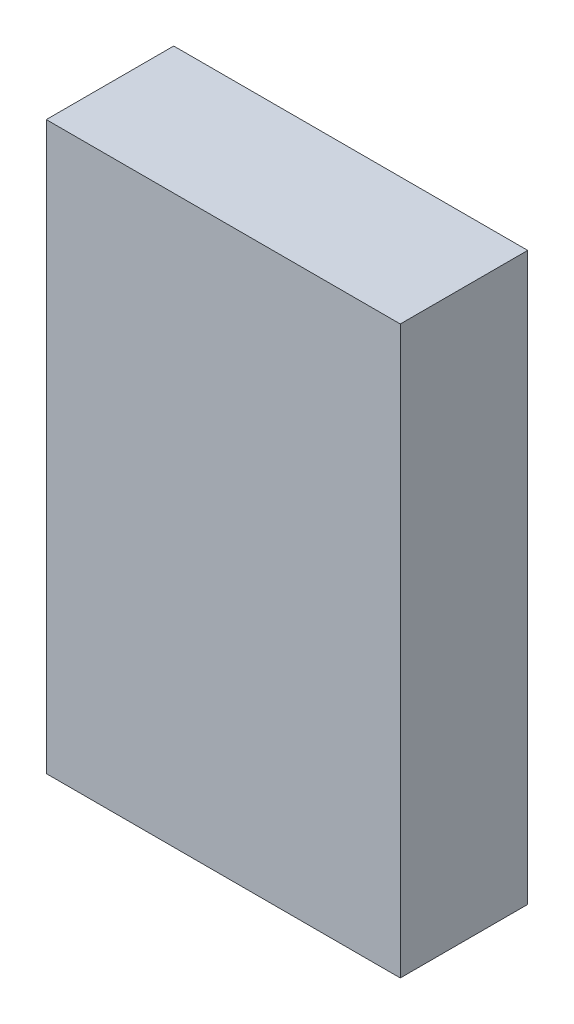
ISO-10303-21;
HEADER;
FILE_DESCRIPTION(('STEP AP214'),'2;1');
FILE_NAME('part.step','',(''),(''),'','','');
FILE_SCHEMA(('AUTOMOTIVE_DESIGN { 1 0 10303 214 1 1 1 1 }'));
ENDSEC;
DATA;
#1=APPLICATION_CONTEXT('core data for automotive mechanical design processes');
#2=APPLICATION_PROTOCOL_DEFINITION('international standard','automotive_design',2000,#1);
#3=PRODUCT_CONTEXT('',#1,'mechanical');
#4=PRODUCT('Part','Part','',(#3));
#5=PRODUCT_RELATED_PRODUCT_CATEGORY('part','',(#4));
#6=PRODUCT_DEFINITION_FORMATION('','',#4);
#7=PRODUCT_DEFINITION_CONTEXT('part definition',#1,'design');
#8=PRODUCT_DEFINITION('design','',#6,#7);
#9=PRODUCT_DEFINITION_SHAPE('','',#8);
#10=(LENGTH_UNIT() NAMED_UNIT(*) SI_UNIT(.MILLI.,.METRE.));
#11=(NAMED_UNIT(*) PLANE_ANGLE_UNIT() SI_UNIT($,.RADIAN.));
#12=(NAMED_UNIT(*) SI_UNIT($,.STERADIAN.) SOLID_ANGLE_UNIT());
#13=UNCERTAINTY_MEASURE_WITH_UNIT(LENGTH_MEASURE(1.E-05),#10,'distance_accuracy_value','');
#14=(GEOMETRIC_REPRESENTATION_CONTEXT(3) GLOBAL_UNCERTAINTY_ASSIGNED_CONTEXT((#13)) GLOBAL_UNIT_ASSIGNED_CONTEXT((#10,
#11,#12)) REPRESENTATION_CONTEXT('',''));
#15=CARTESIAN_POINT('',(0.,0.,0.));
#16=DIRECTION('',(0.,0.,1.));
#17=DIRECTION('',(1.,0.,0.));
#18=AXIS2_PLACEMENT_3D('',#15,#16,#17);
#19=CARTESIAN_POINT('',(-0.62499748,-0.99998784,0.4499991));
#20=DIRECTION('',(0.,0.,1.));
#21=DIRECTION('',(1.,0.,0.));
#22=AXIS2_PLACEMENT_3D('',#19,#20,#21);
#23=PLANE('',#22);
#24=DIRECTION('',(1.,0.,0.));
#25=VECTOR('',#24,1.);
#26=CARTESIAN_POINT('',(-0.62499748,0.999998,0.4499991));
#27=LINE('',#26,#25);
#28=CARTESIAN_POINT('',(-0.62499748,0.999998,0.4499991));
#29=VERTEX_POINT('',#28);
#30=CARTESIAN_POINT('',(0.62500002,0.999998,0.4499991));
#31=VERTEX_POINT('',#30);
#32=EDGE_CURVE('E72',#29,#31,#27,.T.);
#33=ORIENTED_EDGE('',*,*,#32,.F.);
#34=DIRECTION('',(0.,1.,0.));
#35=VECTOR('',#34,1.);
#36=CARTESIAN_POINT('',(-0.62499748,-0.99998784,0.4499991));
#37=LINE('',#36,#35);
#38=CARTESIAN_POINT('',(-0.62499748,-0.999987840000004,0.4499991));
#39=VERTEX_POINT('',#38);
#40=EDGE_CURVE('E65',#39,#29,#37,.T.);
#41=ORIENTED_EDGE('',*,*,#40,.F.);
#42=DIRECTION('',(0.999999999981419,-6.09601218471156E-06,0.));
#43=VECTOR('',#42,1.);
#44=CARTESIAN_POINT('',(0.62500002,-0.99999546,0.4499991));
#45=LINE('',#44,#43);
#46=CARTESIAN_POINT('',(0.62500002,-0.99999546,0.4499991));
#47=VERTEX_POINT('',#46);
#48=EDGE_CURVE('E19',#47,#39,#45,.F.);
#49=ORIENTED_EDGE('',*,*,#48,.F.);
#50=DIRECTION('',(0.,1.,0.));
#51=VECTOR('',#50,1.);
#52=CARTESIAN_POINT('',(0.62500002,0.999998,0.4499991));
#53=LINE('',#52,#51);
#54=EDGE_CURVE('E53',#31,#47,#53,.F.);
#55=ORIENTED_EDGE('',*,*,#54,.F.);
#56=EDGE_LOOP('',(#33,#41,#49,#55));
#57=FACE_BOUND('',#56,.T.);
#58=ADVANCED_FACE('F16',(#57),#23,.T.);
#59=CARTESIAN_POINT('',(0.62500002,-0.99999546,0.));
#60=DIRECTION('',(-6.09601218471156E-06,-0.999999999981419,0.));
#61=DIRECTION('',(0.999999999981419,-6.09601218471156E-06,0.));
#62=AXIS2_PLACEMENT_3D('',#59,#60,#61);
#63=PLANE('',#62);
#64=DIRECTION('',(0.,0.,1.));
#65=VECTOR('',#64,1.);
#66=CARTESIAN_POINT('',(-0.62499748,-0.99998784,0.));
#67=LINE('',#66,#65);
#68=CARTESIAN_POINT('',(-0.62499748,-0.999987840000004,0.));
#69=VERTEX_POINT('',#68);
#70=EDGE_CURVE('E78',#69,#39,#67,.T.);
#71=ORIENTED_EDGE('',*,*,#70,.F.);
#72=DIRECTION('',(0.999999999981419,-6.09601218471156E-06,0.));
#73=VECTOR('',#72,1.);
#74=CARTESIAN_POINT('',(0.62500002,-0.99999546,0.));
#75=LINE('',#74,#73);
#76=CARTESIAN_POINT('',(0.62500002,-0.99999546,0.));
#77=VERTEX_POINT('',#76);
#78=EDGE_CURVE('E71',#69,#77,#75,.T.);
#79=ORIENTED_EDGE('',*,*,#78,.T.);
#80=DIRECTION('',(0.,0.,-1.));
#81=VECTOR('',#80,1.);
#82=CARTESIAN_POINT('',(0.62500002,-0.99999546,0.));
#83=LINE('',#82,#81);
#84=EDGE_CURVE('E58',#47,#77,#83,.T.);
#85=ORIENTED_EDGE('',*,*,#84,.F.);
#86=ORIENTED_EDGE('',*,*,#48,.T.);
#87=EDGE_LOOP('',(#71,#79,#85,#86));
#88=FACE_BOUND('',#87,.T.);
#89=ADVANCED_FACE('F70',(#88),#63,.T.);
#90=CARTESIAN_POINT('',(0.62500002,0.999998,0.));
#91=DIRECTION('',(1.,0.,0.));
#92=DIRECTION('',(0.,0.,-1.));
#93=AXIS2_PLACEMENT_3D('',#90,#91,#92);
#94=PLANE('',#93);
#95=ORIENTED_EDGE('',*,*,#84,.T.);
#96=DIRECTION('',(0.,1.,0.));
#97=VECTOR('',#96,1.);
#98=CARTESIAN_POINT('',(0.62500002,0.999998,0.));
#99=LINE('',#98,#97);
#100=CARTESIAN_POINT('',(0.62500002,0.999998,0.));
#101=VERTEX_POINT('',#100);
#102=EDGE_CURVE('E88',#77,#101,#99,.T.);
#103=ORIENTED_EDGE('',*,*,#102,.T.);
#104=DIRECTION('',(0.,0.,1.));
#105=VECTOR('',#104,1.);
#106=CARTESIAN_POINT('',(0.62500002,0.999998,0.));
#107=LINE('',#106,#105);
#108=EDGE_CURVE('E60',#31,#101,#107,.F.);
#109=ORIENTED_EDGE('',*,*,#108,.F.);
#110=ORIENTED_EDGE('',*,*,#54,.T.);
#111=EDGE_LOOP('',(#95,#103,#109,#110));
#112=FACE_BOUND('',#111,.T.);
#113=ADVANCED_FACE('F55',(#112),#94,.T.);
#114=CARTESIAN_POINT('',(-0.62499748,0.999998,0.));
#115=DIRECTION('',(0.,1.,0.));
#116=DIRECTION('',(0.,0.,1.));
#117=AXIS2_PLACEMENT_3D('',#114,#115,#116);
#118=PLANE('',#117);
#119=ORIENTED_EDGE('',*,*,#108,.T.);
#120=DIRECTION('',(1.,0.,0.));
#121=VECTOR('',#120,1.);
#122=CARTESIAN_POINT('',(-0.62499748,0.999998,0.));
#123=LINE('',#122,#121);
#124=CARTESIAN_POINT('',(-0.62499748,0.999998,0.));
#125=VERTEX_POINT('',#124);
#126=EDGE_CURVE('E25',#101,#125,#123,.F.);
#127=ORIENTED_EDGE('',*,*,#126,.T.);
#128=DIRECTION('',(0.,0.,1.));
#129=VECTOR('',#128,1.);
#130=CARTESIAN_POINT('',(-0.62499748,0.999998,0.));
#131=LINE('',#130,#129);
#132=EDGE_CURVE('E33',#29,#125,#131,.F.);
#133=ORIENTED_EDGE('',*,*,#132,.F.);
#134=ORIENTED_EDGE('',*,*,#32,.T.);
#135=EDGE_LOOP('',(#119,#127,#133,#134));
#136=FACE_BOUND('',#135,.T.);
#137=ADVANCED_FACE('F93',(#136),#118,.T.);
#138=CARTESIAN_POINT('',(-0.62499748,-0.99998784,0.));
#139=DIRECTION('',(-1.,0.,0.));
#140=DIRECTION('',(0.,0.,1.));
#141=AXIS2_PLACEMENT_3D('',#138,#139,#140);
#142=PLANE('',#141);
#143=ORIENTED_EDGE('',*,*,#132,.T.);
#144=DIRECTION('',(0.,1.,0.));
#145=VECTOR('',#144,1.);
#146=CARTESIAN_POINT('',(-0.62499748,-0.99998784,0.));
#147=LINE('',#146,#145);
#148=EDGE_CURVE('E11',#125,#69,#147,.F.);
#149=ORIENTED_EDGE('',*,*,#148,.T.);
#150=ORIENTED_EDGE('',*,*,#70,.T.);
#151=ORIENTED_EDGE('',*,*,#40,.T.);
#152=EDGE_LOOP('',(#143,#149,#150,#151));
#153=FACE_BOUND('',#152,.T.);
#154=ADVANCED_FACE('F96',(#153),#142,.T.);
#155=CARTESIAN_POINT('',(-0.62499748,-0.99998784,0.));
#156=DIRECTION('',(0.,0.,1.));
#157=DIRECTION('',(1.,0.,0.));
#158=AXIS2_PLACEMENT_3D('',#155,#156,#157);
#159=PLANE('',#158);
#160=ORIENTED_EDGE('',*,*,#126,.F.);
#161=ORIENTED_EDGE('',*,*,#102,.F.);
#162=ORIENTED_EDGE('',*,*,#78,.F.);
#163=ORIENTED_EDGE('',*,*,#148,.F.);
#164=EDGE_LOOP('',(#160,#161,#162,#163));
#165=FACE_BOUND('',#164,.T.);
#166=ADVANCED_FACE('F95',(#165),#159,.F.);
#167=CLOSED_SHELL('',(#58,#89,#113,#137,#154,#166));
#168=MANIFOLD_SOLID_BREP('B1',#167);
#169=ADVANCED_BREP_SHAPE_REPRESENTATION('',(#18,#168),#14);
#170=SHAPE_DEFINITION_REPRESENTATION(#9,#169);
ENDSEC;
END-ISO-10303-21;
